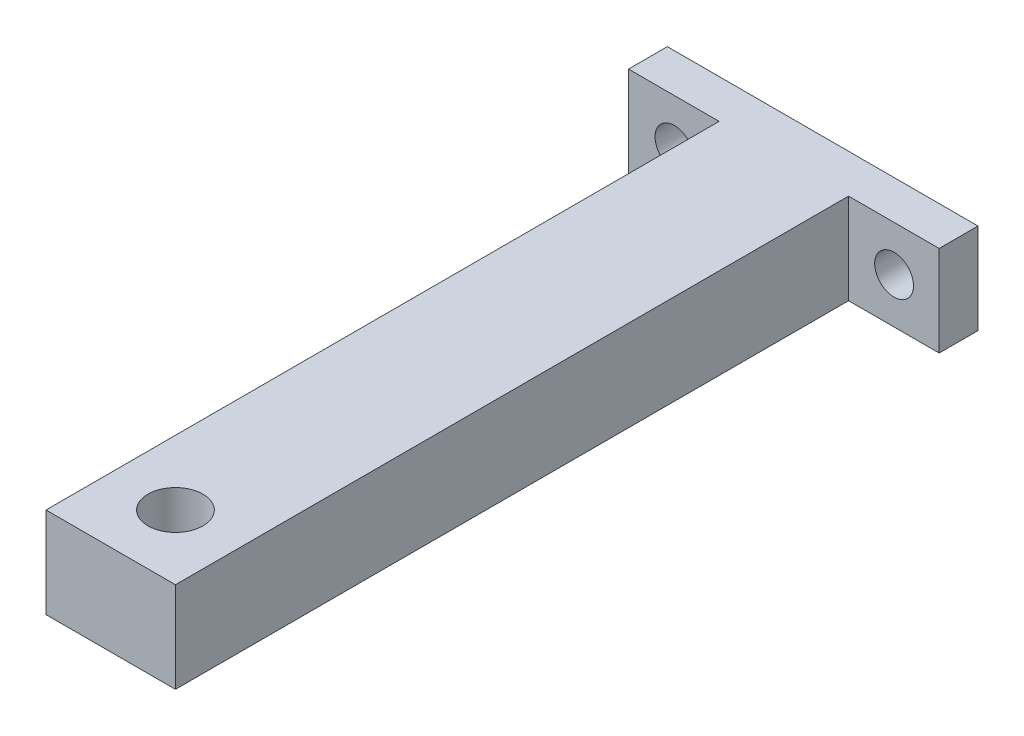
ISO-10303-21;
HEADER;
FILE_DESCRIPTION(('STEP AP214'),'2;1');
FILE_NAME('part.step','',(''),(''),'','','');
FILE_SCHEMA(('AUTOMOTIVE_DESIGN { 1 0 10303 214 1 1 1 1 }'));
ENDSEC;
DATA;
#1=APPLICATION_CONTEXT('core data for automotive mechanical design processes');
#2=APPLICATION_PROTOCOL_DEFINITION('international standard','automotive_design',2000,#1);
#3=PRODUCT_CONTEXT('',#1,'mechanical');
#4=PRODUCT('Part','Part','',(#3));
#5=PRODUCT_RELATED_PRODUCT_CATEGORY('part','',(#4));
#6=PRODUCT_DEFINITION_FORMATION('','',#4);
#7=PRODUCT_DEFINITION_CONTEXT('part definition',#1,'design');
#8=PRODUCT_DEFINITION('design','',#6,#7);
#9=PRODUCT_DEFINITION_SHAPE('','',#8);
#10=(LENGTH_UNIT() NAMED_UNIT(*) SI_UNIT(.MILLI.,.METRE.));
#11=(NAMED_UNIT(*) PLANE_ANGLE_UNIT() SI_UNIT($,.RADIAN.));
#12=(NAMED_UNIT(*) SI_UNIT($,.STERADIAN.) SOLID_ANGLE_UNIT());
#13=UNCERTAINTY_MEASURE_WITH_UNIT(LENGTH_MEASURE(1.E-05),#10,'distance_accuracy_value','');
#14=(GEOMETRIC_REPRESENTATION_CONTEXT(3) GLOBAL_UNCERTAINTY_ASSIGNED_CONTEXT((#13)) GLOBAL_UNIT_ASSIGNED_CONTEXT((#10,
#11,#12)) REPRESENTATION_CONTEXT('',''));
#15=CARTESIAN_POINT('',(0.,0.,0.));
#16=DIRECTION('',(0.,0.,1.));
#17=DIRECTION('',(1.,0.,0.));
#18=AXIS2_PLACEMENT_3D('',#15,#16,#17);
#19=CARTESIAN_POINT('',(0.,0.,3.));
#20=DIRECTION('',(0.,0.,1.));
#21=DIRECTION('',(1.,0.,0.));
#22=AXIS2_PLACEMENT_3D('',#19,#20,#21);
#23=PLANE('',#22);
#24=CARTESIAN_POINT('',(-8.45234213110757,0.,3.));
#25=DIRECTION('',(0.,0.,1.));
#26=DIRECTION('',(1.,0.,0.));
#27=AXIS2_PLACEMENT_3D('',#24,#25,#26);
#28=CIRCLE('',#27,1.5);
#29=CARTESIAN_POINT('',(-6.95234213110757,0.,3.));
#30=VERTEX_POINT('',#29);
#31=EDGE_CURVE('E208',#30,#30,#28,.T.);
#32=ORIENTED_EDGE('',*,*,#31,.F.);
#33=EDGE_LOOP('',(#32));
#34=FACE_BOUND('',#33,.T.);
#35=DIRECTION('',(0.,-1.,0.));
#36=VECTOR('',#35,1.);
#37=CARTESIAN_POINT('',(-5.,3.5,3.));
#38=LINE('',#37,#36);
#39=CARTESIAN_POINT('',(-5.,3.5,3.));
#40=VERTEX_POINT('',#39);
#41=CARTESIAN_POINT('',(-5.,-3.5,3.));
#42=VERTEX_POINT('',#41);
#43=EDGE_CURVE('E119',#40,#42,#38,.T.);
#44=ORIENTED_EDGE('',*,*,#43,.F.);
#45=DIRECTION('',(-1.,0.,0.));
#46=VECTOR('',#45,1.);
#47=CARTESIAN_POINT('',(-12.,3.5,3.));
#48=LINE('',#47,#46);
#49=CARTESIAN_POINT('',(-12.,3.5,3.));
#50=VERTEX_POINT('',#49);
#51=EDGE_CURVE('E132',#40,#50,#48,.T.);
#52=ORIENTED_EDGE('',*,*,#51,.T.);
#53=DIRECTION('',(0.,-1.,0.));
#54=VECTOR('',#53,1.);
#55=CARTESIAN_POINT('',(-12.,3.5,3.));
#56=LINE('',#55,#54);
#57=CARTESIAN_POINT('',(-12.,-3.5,3.));
#58=VERTEX_POINT('',#57);
#59=EDGE_CURVE('E136',#50,#58,#56,.T.);
#60=ORIENTED_EDGE('',*,*,#59,.T.);
#61=DIRECTION('',(1.,0.,0.));
#62=VECTOR('',#61,1.);
#63=CARTESIAN_POINT('',(-12.,-3.5,3.));
#64=LINE('',#63,#62);
#65=EDGE_CURVE('E56',#58,#42,#64,.T.);
#66=ORIENTED_EDGE('',*,*,#65,.T.);
#67=EDGE_LOOP('',(#44,#52,#60,#66));
#68=FACE_BOUND('',#67,.T.);
#69=ADVANCED_FACE('F33',(#34,#68),#23,.T.);
#70=CARTESIAN_POINT('',(12.,3.5,3.));
#71=DIRECTION('',(-1.,0.,0.));
#72=DIRECTION('',(0.,0.,1.));
#73=AXIS2_PLACEMENT_3D('',#70,#71,#72);
#74=PLANE('',#73);
#75=DIRECTION('',(0.,1.,0.));
#76=VECTOR('',#75,1.);
#77=CARTESIAN_POINT('',(12.,3.5,0.));
#78=LINE('',#77,#76);
#79=CARTESIAN_POINT('',(12.,-3.5,0.));
#80=VERTEX_POINT('',#79);
#81=CARTESIAN_POINT('',(12.,3.5,0.));
#82=VERTEX_POINT('',#81);
#83=EDGE_CURVE('E120',#80,#82,#78,.T.);
#84=ORIENTED_EDGE('',*,*,#83,.T.);
#85=DIRECTION('',(0.,0.,-1.));
#86=VECTOR('',#85,1.);
#87=CARTESIAN_POINT('',(12.,3.5,3.));
#88=LINE('',#87,#86);
#89=CARTESIAN_POINT('',(12.,3.5,3.));
#90=VERTEX_POINT('',#89);
#91=EDGE_CURVE('E11',#90,#82,#88,.T.);
#92=ORIENTED_EDGE('',*,*,#91,.F.);
#93=DIRECTION('',(0.,1.,0.));
#94=VECTOR('',#93,1.);
#95=CARTESIAN_POINT('',(12.,3.5,3.));
#96=LINE('',#95,#94);
#97=CARTESIAN_POINT('',(12.,-3.5,3.));
#98=VERTEX_POINT('',#97);
#99=EDGE_CURVE('E129',#98,#90,#96,.T.);
#100=ORIENTED_EDGE('',*,*,#99,.F.);
#101=DIRECTION('',(0.,0.,-1.));
#102=VECTOR('',#101,1.);
#103=CARTESIAN_POINT('',(12.,-3.5,3.));
#104=LINE('',#103,#102);
#105=EDGE_CURVE('E139',#98,#80,#104,.T.);
#106=ORIENTED_EDGE('',*,*,#105,.T.);
#107=EDGE_LOOP('',(#84,#92,#100,#106));
#108=FACE_BOUND('',#107,.T.);
#109=ADVANCED_FACE('F35',(#108),#74,.F.);
#110=CARTESIAN_POINT('',(-12.,3.5,3.));
#111=DIRECTION('',(0.,-1.,0.));
#112=DIRECTION('',(0.,0.,-1.));
#113=AXIS2_PLACEMENT_3D('',#110,#111,#112);
#114=PLANE('',#113);
#115=CARTESIAN_POINT('',(0.,3.5,50.));
#116=DIRECTION('',(0.,-1.,0.));
#117=DIRECTION('',(0.,0.,-1.));
#118=AXIS2_PLACEMENT_3D('',#115,#116,#117);
#119=CIRCLE('',#118,2.125);
#120=CARTESIAN_POINT('',(0.,3.5,47.875));
#121=VERTEX_POINT('',#120);
#122=EDGE_CURVE('E176',#121,#121,#119,.T.);
#123=ORIENTED_EDGE('',*,*,#122,.T.);
#124=EDGE_LOOP('',(#123));
#125=FACE_BOUND('',#124,.T.);
#126=DIRECTION('',(-1.,0.,0.));
#127=VECTOR('',#126,1.);
#128=CARTESIAN_POINT('',(-12.,3.5,0.));
#129=LINE('',#128,#127);
#130=CARTESIAN_POINT('',(-12.,3.5,0.));
#131=VERTEX_POINT('',#130);
#132=EDGE_CURVE('E123',#82,#131,#129,.T.);
#133=ORIENTED_EDGE('',*,*,#132,.T.);
#134=DIRECTION('',(0.,0.,-1.));
#135=VECTOR('',#134,1.);
#136=CARTESIAN_POINT('',(-12.,3.5,3.));
#137=LINE('',#136,#135);
#138=EDGE_CURVE('E41',#50,#131,#137,.T.);
#139=ORIENTED_EDGE('',*,*,#138,.F.);
#140=ORIENTED_EDGE('',*,*,#51,.F.);
#141=DIRECTION('',(0.,0.,-1.));
#142=VECTOR('',#141,1.);
#143=CARTESIAN_POINT('',(-5.,3.5,55.));
#144=LINE('',#143,#142);
#145=CARTESIAN_POINT('',(-5.,3.5,55.));
#146=VERTEX_POINT('',#145);
#147=EDGE_CURVE('E172',#146,#40,#144,.T.);
#148=ORIENTED_EDGE('',*,*,#147,.F.);
#149=DIRECTION('',(-1.,0.,0.));
#150=VECTOR('',#149,1.);
#151=CARTESIAN_POINT('',(-5.,3.5,55.));
#152=LINE('',#151,#150);
#153=CARTESIAN_POINT('',(5.,3.5,55.));
#154=VERTEX_POINT('',#153);
#155=EDGE_CURVE('E113',#154,#146,#152,.T.);
#156=ORIENTED_EDGE('',*,*,#155,.F.);
#157=DIRECTION('',(0.,0.,-1.));
#158=VECTOR('',#157,1.);
#159=CARTESIAN_POINT('',(5.,3.5,55.));
#160=LINE('',#159,#158);
#161=CARTESIAN_POINT('',(5.,3.5,3.));
#162=VERTEX_POINT('',#161);
#163=EDGE_CURVE('E125',#154,#162,#160,.T.);
#164=ORIENTED_EDGE('',*,*,#163,.T.);
#165=EDGE_CURVE('E134',#90,#162,#48,.T.);
#166=ORIENTED_EDGE('',*,*,#165,.F.);
#167=ORIENTED_EDGE('',*,*,#91,.T.);
#168=EDGE_LOOP('',(#133,#139,#140,#148,#156,#164,#166,#167));
#169=FACE_BOUND('',#168,.T.);
#170=ADVANCED_FACE('F178',(#125,#169),#114,.F.);
#171=CARTESIAN_POINT('',(-12.,3.5,3.));
#172=DIRECTION('',(1.,0.,0.));
#173=DIRECTION('',(0.,0.,-1.));
#174=AXIS2_PLACEMENT_3D('',#171,#172,#173);
#175=PLANE('',#174);
#176=DIRECTION('',(0.,-1.,0.));
#177=VECTOR('',#176,1.);
#178=CARTESIAN_POINT('',(-12.,3.5,0.));
#179=LINE('',#178,#177);
#180=CARTESIAN_POINT('',(-12.,-3.5,0.));
#181=VERTEX_POINT('',#180);
#182=EDGE_CURVE('E142',#131,#181,#179,.T.);
#183=ORIENTED_EDGE('',*,*,#182,.T.);
#184=DIRECTION('',(0.,0.,-1.));
#185=VECTOR('',#184,1.);
#186=CARTESIAN_POINT('',(-12.,-3.5,3.));
#187=LINE('',#186,#185);
#188=EDGE_CURVE('E147',#58,#181,#187,.T.);
#189=ORIENTED_EDGE('',*,*,#188,.F.);
#190=ORIENTED_EDGE('',*,*,#59,.F.);
#191=ORIENTED_EDGE('',*,*,#138,.T.);
#192=EDGE_LOOP('',(#183,#189,#190,#191));
#193=FACE_BOUND('',#192,.T.);
#194=ADVANCED_FACE('F154',(#193),#175,.F.);
#195=CARTESIAN_POINT('',(-12.,-3.5,3.));
#196=DIRECTION('',(0.,1.,0.));
#197=DIRECTION('',(0.,0.,1.));
#198=AXIS2_PLACEMENT_3D('',#195,#196,#197);
#199=PLANE('',#198);
#200=CARTESIAN_POINT('',(0.,-3.5,50.));
#201=DIRECTION('',(0.,-1.,0.));
#202=DIRECTION('',(0.,0.,-1.));
#203=AXIS2_PLACEMENT_3D('',#200,#201,#202);
#204=CIRCLE('',#203,2.125);
#205=CARTESIAN_POINT('',(0.,-3.5,47.875));
#206=VERTEX_POINT('',#205);
#207=EDGE_CURVE('E205',#206,#206,#204,.T.);
#208=ORIENTED_EDGE('',*,*,#207,.F.);
#209=EDGE_LOOP('',(#208));
#210=FACE_BOUND('',#209,.T.);
#211=DIRECTION('',(1.,0.,0.));
#212=VECTOR('',#211,1.);
#213=CARTESIAN_POINT('',(-12.,-3.5,0.));
#214=LINE('',#213,#212);
#215=EDGE_CURVE('E133',#181,#80,#214,.T.);
#216=ORIENTED_EDGE('',*,*,#215,.T.);
#217=ORIENTED_EDGE('',*,*,#105,.F.);
#218=CARTESIAN_POINT('',(5.,-3.5,3.));
#219=VERTEX_POINT('',#218);
#220=EDGE_CURVE('E138',#219,#98,#64,.T.);
#221=ORIENTED_EDGE('',*,*,#220,.F.);
#222=DIRECTION('',(0.,0.,-1.));
#223=VECTOR('',#222,1.);
#224=CARTESIAN_POINT('',(5.,-3.5,55.));
#225=LINE('',#224,#223);
#226=CARTESIAN_POINT('',(5.,-3.5,55.));
#227=VERTEX_POINT('',#226);
#228=EDGE_CURVE('E104',#227,#219,#225,.T.);
#229=ORIENTED_EDGE('',*,*,#228,.F.);
#230=DIRECTION('',(1.,0.,0.));
#231=VECTOR('',#230,1.);
#232=CARTESIAN_POINT('',(-5.,-3.5,55.));
#233=LINE('',#232,#231);
#234=CARTESIAN_POINT('',(-5.,-3.5,55.));
#235=VERTEX_POINT('',#234);
#236=EDGE_CURVE('E97',#235,#227,#233,.T.);
#237=ORIENTED_EDGE('',*,*,#236,.F.);
#238=DIRECTION('',(0.,0.,-1.));
#239=VECTOR('',#238,1.);
#240=CARTESIAN_POINT('',(-5.,-3.5,55.));
#241=LINE('',#240,#239);
#242=EDGE_CURVE('E101',#235,#42,#241,.T.);
#243=ORIENTED_EDGE('',*,*,#242,.T.);
#244=ORIENTED_EDGE('',*,*,#65,.F.);
#245=ORIENTED_EDGE('',*,*,#188,.T.);
#246=EDGE_LOOP('',(#216,#217,#221,#229,#237,#243,#244,#245));
#247=FACE_BOUND('',#246,.T.);
#248=ADVANCED_FACE('F99',(#210,#247),#199,.F.);
#249=CARTESIAN_POINT('',(8.51648456826126,0.,3.));
#250=DIRECTION('',(0.,0.,1.));
#251=DIRECTION('',(1.,0.,0.));
#252=AXIS2_PLACEMENT_3D('',#249,#250,#251);
#253=CIRCLE('',#252,1.5);
#254=CARTESIAN_POINT('',(10.0164845682613,0.,3.));
#255=VERTEX_POINT('',#254);
#256=EDGE_CURVE('E199',#255,#255,#253,.T.);
#257=ORIENTED_EDGE('',*,*,#256,.F.);
#258=EDGE_LOOP('',(#257));
#259=FACE_BOUND('',#258,.T.);
#260=DIRECTION('',(0.,1.,0.));
#261=VECTOR('',#260,1.);
#262=CARTESIAN_POINT('',(5.,3.5,3.));
#263=LINE('',#262,#261);
#264=EDGE_CURVE('E48',#219,#162,#263,.T.);
#265=ORIENTED_EDGE('',*,*,#264,.F.);
#266=ORIENTED_EDGE('',*,*,#220,.T.);
#267=ORIENTED_EDGE('',*,*,#99,.T.);
#268=ORIENTED_EDGE('',*,*,#165,.T.);
#269=EDGE_LOOP('',(#265,#266,#267,#268));
#270=FACE_BOUND('',#269,.T.);
#271=ADVANCED_FACE('F166',(#259,#270),#23,.T.);
#272=CARTESIAN_POINT('',(0.,0.,0.));
#273=DIRECTION('',(0.,0.,1.));
#274=DIRECTION('',(1.,0.,0.));
#275=AXIS2_PLACEMENT_3D('',#272,#273,#274);
#276=PLANE('',#275);
#277=CARTESIAN_POINT('',(-8.45234213110757,0.,0.));
#278=DIRECTION('',(0.,0.,1.));
#279=DIRECTION('',(1.,0.,0.));
#280=AXIS2_PLACEMENT_3D('',#277,#278,#279);
#281=CIRCLE('',#280,1.5);
#282=CARTESIAN_POINT('',(-6.95234213110757,0.,0.));
#283=VERTEX_POINT('',#282);
#284=EDGE_CURVE('E202',#283,#283,#281,.T.);
#285=ORIENTED_EDGE('',*,*,#284,.T.);
#286=EDGE_LOOP('',(#285));
#287=FACE_BOUND('',#286,.T.);
#288=CARTESIAN_POINT('',(8.51648456826126,0.,0.));
#289=DIRECTION('',(0.,0.,1.));
#290=DIRECTION('',(1.,0.,0.));
#291=AXIS2_PLACEMENT_3D('',#288,#289,#290);
#292=CIRCLE('',#291,1.5);
#293=CARTESIAN_POINT('',(10.0164845682613,0.,0.));
#294=VERTEX_POINT('',#293);
#295=EDGE_CURVE('E201',#294,#294,#292,.T.);
#296=ORIENTED_EDGE('',*,*,#295,.T.);
#297=EDGE_LOOP('',(#296));
#298=FACE_BOUND('',#297,.T.);
#299=ORIENTED_EDGE('',*,*,#83,.F.);
#300=ORIENTED_EDGE('',*,*,#215,.F.);
#301=ORIENTED_EDGE('',*,*,#182,.F.);
#302=ORIENTED_EDGE('',*,*,#132,.F.);
#303=EDGE_LOOP('',(#299,#300,#301,#302));
#304=FACE_BOUND('',#303,.T.);
#305=ADVANCED_FACE('F161',(#287,#298,#304),#276,.F.);
#306=CARTESIAN_POINT('',(-5.,3.5,55.));
#307=DIRECTION('',(1.,0.,0.));
#308=DIRECTION('',(0.,1.,0.));
#309=AXIS2_PLACEMENT_3D('',#306,#307,#308);
#310=PLANE('',#309);
#311=ORIENTED_EDGE('',*,*,#43,.T.);
#312=ORIENTED_EDGE('',*,*,#242,.F.);
#313=DIRECTION('',(0.,-1.,0.));
#314=VECTOR('',#313,1.);
#315=CARTESIAN_POINT('',(-5.,3.5,55.));
#316=LINE('',#315,#314);
#317=EDGE_CURVE('E108',#146,#235,#316,.T.);
#318=ORIENTED_EDGE('',*,*,#317,.F.);
#319=ORIENTED_EDGE('',*,*,#147,.T.);
#320=EDGE_LOOP('',(#311,#312,#318,#319));
#321=FACE_BOUND('',#320,.T.);
#322=ADVANCED_FACE('F118',(#321),#310,.F.);
#323=CARTESIAN_POINT('',(5.,3.5,55.));
#324=DIRECTION('',(-1.,0.,0.));
#325=DIRECTION('',(0.,0.,1.));
#326=AXIS2_PLACEMENT_3D('',#323,#324,#325);
#327=PLANE('',#326);
#328=ORIENTED_EDGE('',*,*,#264,.T.);
#329=ORIENTED_EDGE('',*,*,#163,.F.);
#330=DIRECTION('',(0.,1.,0.));
#331=VECTOR('',#330,1.);
#332=CARTESIAN_POINT('',(5.,3.5,55.));
#333=LINE('',#332,#331);
#334=EDGE_CURVE('E107',#227,#154,#333,.T.);
#335=ORIENTED_EDGE('',*,*,#334,.F.);
#336=ORIENTED_EDGE('',*,*,#228,.T.);
#337=EDGE_LOOP('',(#328,#329,#335,#336));
#338=FACE_BOUND('',#337,.T.);
#339=ADVANCED_FACE('F168',(#338),#327,.F.);
#340=CARTESIAN_POINT('',(0.,0.,55.));
#341=DIRECTION('',(0.,0.,1.));
#342=DIRECTION('',(1.,0.,0.));
#343=AXIS2_PLACEMENT_3D('',#340,#341,#342);
#344=PLANE('',#343);
#345=ORIENTED_EDGE('',*,*,#317,.T.);
#346=ORIENTED_EDGE('',*,*,#236,.T.);
#347=ORIENTED_EDGE('',*,*,#334,.T.);
#348=ORIENTED_EDGE('',*,*,#155,.T.);
#349=EDGE_LOOP('',(#345,#346,#347,#348));
#350=FACE_BOUND('',#349,.T.);
#351=ADVANCED_FACE('F111',(#350),#344,.T.);
#352=CARTESIAN_POINT('',(0.,3.5,50.));
#353=DIRECTION('',(0.,-1.,0.));
#354=DIRECTION('',(0.,0.,-1.));
#355=AXIS2_PLACEMENT_3D('',#352,#353,#354);
#356=CYLINDRICAL_SURFACE('',#355,2.125);
#357=ORIENTED_EDGE('',*,*,#122,.F.);
#358=EDGE_LOOP('',(#357));
#359=FACE_BOUND('',#358,.T.);
#360=ORIENTED_EDGE('',*,*,#207,.T.);
#361=EDGE_LOOP('',(#360));
#362=FACE_BOUND('',#361,.T.);
#363=ADVANCED_FACE('F217',(#359,#362),#356,.F.);
#364=CARTESIAN_POINT('',(8.51648456826126,0.,0.));
#365=DIRECTION('',(0.,0.,1.));
#366=DIRECTION('',(1.,0.,0.));
#367=AXIS2_PLACEMENT_3D('',#364,#365,#366);
#368=CYLINDRICAL_SURFACE('',#367,1.5);
#369=ORIENTED_EDGE('',*,*,#295,.F.);
#370=EDGE_LOOP('',(#369));
#371=FACE_BOUND('',#370,.T.);
#372=ORIENTED_EDGE('',*,*,#256,.T.);
#373=EDGE_LOOP('',(#372));
#374=FACE_BOUND('',#373,.T.);
#375=ADVANCED_FACE('F219',(#371,#374),#368,.F.);
#376=CARTESIAN_POINT('',(-8.45234213110757,0.,0.));
#377=DIRECTION('',(0.,0.,1.));
#378=DIRECTION('',(1.,0.,0.));
#379=AXIS2_PLACEMENT_3D('',#376,#377,#378);
#380=CYLINDRICAL_SURFACE('',#379,1.5);
#381=ORIENTED_EDGE('',*,*,#284,.F.);
#382=EDGE_LOOP('',(#381));
#383=FACE_BOUND('',#382,.T.);
#384=ORIENTED_EDGE('',*,*,#31,.T.);
#385=EDGE_LOOP('',(#384));
#386=FACE_BOUND('',#385,.T.);
#387=ADVANCED_FACE('F226',(#383,#386),#380,.F.);
#388=CLOSED_SHELL('',(#69,#109,#170,#194,#248,#271,#305,#322,#339,#351,#363,#375,#387));
#389=MANIFOLD_SOLID_BREP('B2',#388);
#390=ADVANCED_BREP_SHAPE_REPRESENTATION('',(#18,#389),#14);
#391=SHAPE_DEFINITION_REPRESENTATION(#9,#390);
ENDSEC;
END-ISO-10303-21;
